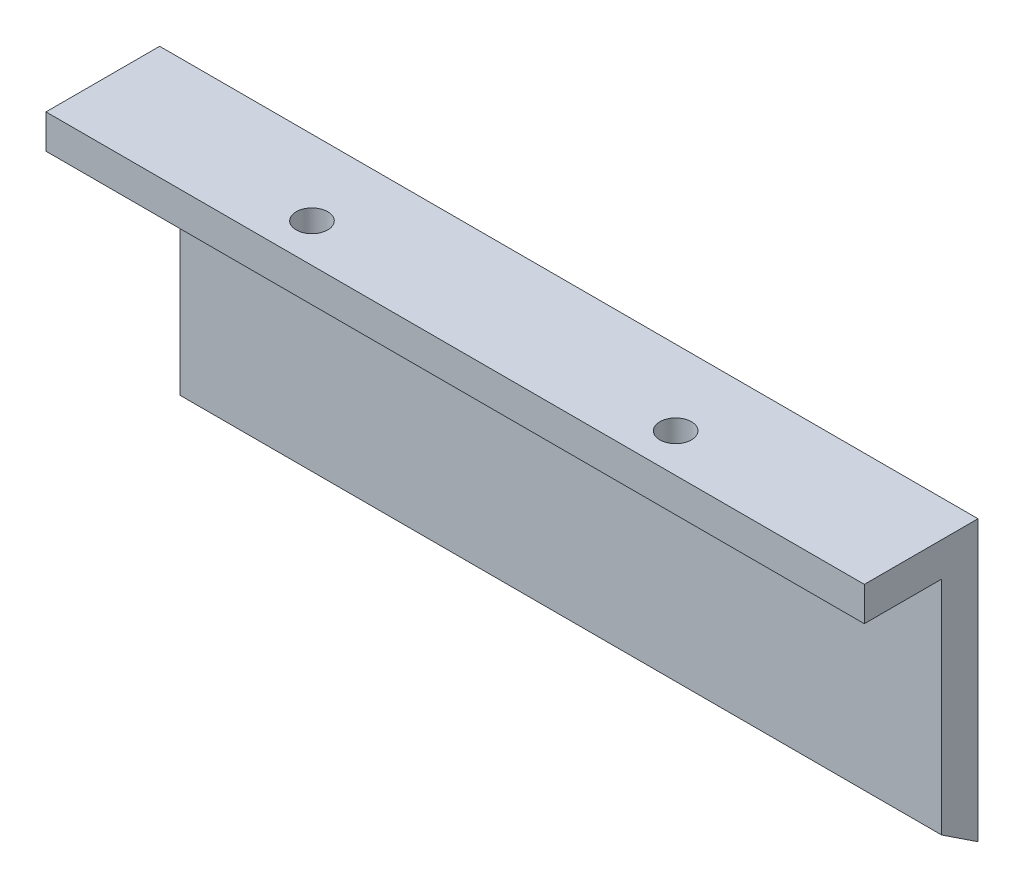
ISO-10303-21;
HEADER;
FILE_DESCRIPTION(('STEP AP214'),'2;1');
FILE_NAME('part.step','',(''),(''),'','','');
FILE_SCHEMA(('AUTOMOTIVE_DESIGN { 1 0 10303 214 1 1 1 1 }'));
ENDSEC;
DATA;
#1=APPLICATION_CONTEXT('core data for automotive mechanical design processes');
#2=APPLICATION_PROTOCOL_DEFINITION('international standard','automotive_design',2000,#1);
#3=PRODUCT_CONTEXT('',#1,'mechanical');
#4=PRODUCT('Part','Part','',(#3));
#5=PRODUCT_RELATED_PRODUCT_CATEGORY('part','',(#4));
#6=PRODUCT_DEFINITION_FORMATION('','',#4);
#7=PRODUCT_DEFINITION_CONTEXT('part definition',#1,'design');
#8=PRODUCT_DEFINITION('design','',#6,#7);
#9=PRODUCT_DEFINITION_SHAPE('','',#8);
#10=(LENGTH_UNIT() NAMED_UNIT(*) SI_UNIT(.MILLI.,.METRE.));
#11=(NAMED_UNIT(*) PLANE_ANGLE_UNIT() SI_UNIT($,.RADIAN.));
#12=(NAMED_UNIT(*) SI_UNIT($,.STERADIAN.) SOLID_ANGLE_UNIT());
#13=UNCERTAINTY_MEASURE_WITH_UNIT(LENGTH_MEASURE(1.E-05),#10,'distance_accuracy_value','');
#14=(GEOMETRIC_REPRESENTATION_CONTEXT(3) GLOBAL_UNCERTAINTY_ASSIGNED_CONTEXT((#13)) GLOBAL_UNIT_ASSIGNED_CONTEXT((#10,
#11,#12)) REPRESENTATION_CONTEXT('',''));
#15=CARTESIAN_POINT('',(0.,0.,0.));
#16=DIRECTION('',(0.,0.,1.));
#17=DIRECTION('',(1.,0.,0.));
#18=AXIS2_PLACEMENT_3D('',#15,#16,#17);
#19=CARTESIAN_POINT('',(67.,21.6124160592128,0.));
#20=DIRECTION('',(0.,0.,1.));
#21=DIRECTION('',(1.,0.,0.));
#22=AXIS2_PLACEMENT_3D('',#19,#20,#21);
#23=PLANE('',#22);
#24=DIRECTION('',(0.,1.,0.));
#25=VECTOR('',#24,1.);
#26=CARTESIAN_POINT('',(0.,21.6124160592128,0.));
#27=LINE('',#26,#25);
#28=CARTESIAN_POINT('',(0.,0.,0.));
#29=VERTEX_POINT('',#28);
#30=CARTESIAN_POINT('',(0.,21.6124160592128,0.));
#31=VERTEX_POINT('',#30);
#32=EDGE_CURVE('E82',#29,#31,#27,.T.);
#33=ORIENTED_EDGE('',*,*,#32,.T.);
#34=DIRECTION('',(-1.,0.,0.));
#35=VECTOR('',#34,1.);
#36=CARTESIAN_POINT('',(67.,21.6124160592128,0.));
#37=LINE('',#36,#35);
#38=CARTESIAN_POINT('',(-4.99999999999999,21.6124160592128,0.));
#39=VERTEX_POINT('',#38);
#40=EDGE_CURVE('E113',#31,#39,#37,.T.);
#41=ORIENTED_EDGE('',*,*,#40,.T.);
#42=DIRECTION('',(0.,-1.,0.));
#43=VECTOR('',#42,1.);
#44=CARTESIAN_POINT('',(-4.99999999999999,24.6124160592128,0.));
#45=LINE('',#44,#43);
#46=CARTESIAN_POINT('',(-4.99999999999999,24.6124160592128,0.));
#47=VERTEX_POINT('',#46);
#48=EDGE_CURVE('E88',#47,#39,#45,.T.);
#49=ORIENTED_EDGE('',*,*,#48,.F.);
#50=DIRECTION('',(-1.,0.,0.));
#51=VECTOR('',#50,1.);
#52=CARTESIAN_POINT('',(67.,24.6124160592128,0.));
#53=LINE('',#52,#51);
#54=CARTESIAN_POINT('',(67.,24.6124160592128,0.));
#55=VERTEX_POINT('',#54);
#56=EDGE_CURVE('E124',#55,#47,#53,.T.);
#57=ORIENTED_EDGE('',*,*,#56,.F.);
#58=DIRECTION('',(0.,1.,0.));
#59=VECTOR('',#58,1.);
#60=CARTESIAN_POINT('',(67.,21.6124160592128,0.));
#61=LINE('',#60,#59);
#62=CARTESIAN_POINT('',(67.,0.,0.));
#63=VERTEX_POINT('',#62);
#64=EDGE_CURVE('E77',#63,#55,#61,.T.);
#65=ORIENTED_EDGE('',*,*,#64,.F.);
#66=DIRECTION('',(-1.,0.,0.));
#67=VECTOR('',#66,1.);
#68=CARTESIAN_POINT('',(67.,0.,0.));
#69=LINE('',#68,#67);
#70=EDGE_CURVE('E73',#63,#29,#69,.T.);
#71=ORIENTED_EDGE('',*,*,#70,.T.);
#72=EDGE_LOOP('',(#33,#41,#49,#57,#65,#71));
#73=FACE_BOUND('',#72,.T.);
#74=ADVANCED_FACE('F36',(#73),#23,.F.);
#75=CARTESIAN_POINT('',(67.,2.11241605921285,3.2));
#76=DIRECTION('',(0.,0.,-1.));
#77=DIRECTION('',(0.,1.,0.));
#78=AXIS2_PLACEMENT_3D('',#75,#76,#77);
#79=PLANE('',#78);
#80=DIRECTION('',(0.,-1.,0.));
#81=VECTOR('',#80,1.);
#82=CARTESIAN_POINT('',(0.,2.11241605921285,3.2));
#83=LINE('',#82,#81);
#84=CARTESIAN_POINT('',(0.,21.6124160592128,3.2));
#85=VERTEX_POINT('',#84);
#86=CARTESIAN_POINT('',(0.,2.11241605921285,3.2));
#87=VERTEX_POINT('',#86);
#88=EDGE_CURVE('E65',#85,#87,#83,.T.);
#89=ORIENTED_EDGE('',*,*,#88,.T.);
#90=DIRECTION('',(-1.,0.,0.));
#91=VECTOR('',#90,1.);
#92=CARTESIAN_POINT('',(67.,2.11241605921285,3.2));
#93=LINE('',#92,#91);
#94=CARTESIAN_POINT('',(67.,2.11241605921285,3.2));
#95=VERTEX_POINT('',#94);
#96=EDGE_CURVE('E44',#95,#87,#93,.T.);
#97=ORIENTED_EDGE('',*,*,#96,.F.);
#98=DIRECTION('',(0.,-1.,0.));
#99=VECTOR('',#98,1.);
#100=CARTESIAN_POINT('',(67.,2.11241605921285,3.2));
#101=LINE('',#100,#99);
#102=CARTESIAN_POINT('',(67.,21.6124160592128,3.2));
#103=VERTEX_POINT('',#102);
#104=EDGE_CURVE('E97',#103,#95,#101,.T.);
#105=ORIENTED_EDGE('',*,*,#104,.F.);
#106=DIRECTION('',(-1.,0.,0.));
#107=VECTOR('',#106,1.);
#108=CARTESIAN_POINT('',(67.,21.6124160592128,3.2));
#109=LINE('',#108,#107);
#110=EDGE_CURVE('E11',#103,#85,#109,.T.);
#111=ORIENTED_EDGE('',*,*,#110,.T.);
#112=EDGE_LOOP('',(#89,#97,#105,#111));
#113=FACE_BOUND('',#112,.T.);
#114=ADVANCED_FACE('F183',(#113),#79,.F.);
#115=CARTESIAN_POINT('',(67.,0.,0.));
#116=DIRECTION('',(0.,0.834559517795937,-0.550917789925333));
#117=DIRECTION('',(0.,0.550917789925333,0.834559517795937));
#118=AXIS2_PLACEMENT_3D('',#115,#116,#117);
#119=PLANE('',#118);
#120=DIRECTION('',(0.,-0.550917789925333,-0.834559517795937));
#121=VECTOR('',#120,1.);
#122=CARTESIAN_POINT('',(0.,0.,0.));
#123=LINE('',#122,#121);
#124=EDGE_CURVE('E70',#87,#29,#123,.T.);
#125=ORIENTED_EDGE('',*,*,#124,.T.);
#126=ORIENTED_EDGE('',*,*,#70,.F.);
#127=DIRECTION('',(0.,-0.550917789925333,-0.834559517795937));
#128=VECTOR('',#127,1.);
#129=CARTESIAN_POINT('',(67.,0.,0.));
#130=LINE('',#129,#128);
#131=EDGE_CURVE('E52',#95,#63,#130,.T.);
#132=ORIENTED_EDGE('',*,*,#131,.F.);
#133=ORIENTED_EDGE('',*,*,#96,.T.);
#134=EDGE_LOOP('',(#125,#126,#132,#133));
#135=FACE_BOUND('',#134,.T.);
#136=ADVANCED_FACE('F72',(#135),#119,.F.);
#137=CARTESIAN_POINT('',(67.,0.,0.));
#138=DIRECTION('',(1.,0.,0.));
#139=DIRECTION('',(0.,0.,-1.));
#140=AXIS2_PLACEMENT_3D('',#137,#138,#139);
#141=PLANE('',#140);
#142=ORIENTED_EDGE('',*,*,#64,.T.);
#143=DIRECTION('',(0.,0.,-1.));
#144=VECTOR('',#143,1.);
#145=CARTESIAN_POINT('',(67.,24.6124160592128,0.));
#146=LINE('',#145,#144);
#147=CARTESIAN_POINT('',(67.,24.6124160592128,10.));
#148=VERTEX_POINT('',#147);
#149=EDGE_CURVE('E109',#148,#55,#146,.T.);
#150=ORIENTED_EDGE('',*,*,#149,.F.);
#151=DIRECTION('',(0.,-1.,0.));
#152=VECTOR('',#151,1.);
#153=CARTESIAN_POINT('',(67.,24.6124160592128,10.));
#154=LINE('',#153,#152);
#155=CARTESIAN_POINT('',(67.,21.6124160592128,10.));
#156=VERTEX_POINT('',#155);
#157=EDGE_CURVE('E102',#148,#156,#154,.T.);
#158=ORIENTED_EDGE('',*,*,#157,.T.);
#159=DIRECTION('',(0.,0.,-1.));
#160=VECTOR('',#159,1.);
#161=CARTESIAN_POINT('',(67.,21.6124160592128,0.));
#162=LINE('',#161,#160);
#163=EDGE_CURVE('E115',#156,#103,#162,.T.);
#164=ORIENTED_EDGE('',*,*,#163,.T.);
#165=ORIENTED_EDGE('',*,*,#104,.T.);
#166=ORIENTED_EDGE('',*,*,#131,.T.);
#167=EDGE_LOOP('',(#142,#150,#158,#164,#165,#166));
#168=FACE_BOUND('',#167,.T.);
#169=ADVANCED_FACE('F181',(#168),#141,.T.);
#170=CARTESIAN_POINT('',(0.,0.,0.));
#171=DIRECTION('',(1.,0.,0.));
#172=DIRECTION('',(0.,0.,-1.));
#173=AXIS2_PLACEMENT_3D('',#170,#171,#172);
#174=PLANE('',#173);
#175=ORIENTED_EDGE('',*,*,#32,.F.);
#176=ORIENTED_EDGE('',*,*,#124,.F.);
#177=ORIENTED_EDGE('',*,*,#88,.F.);
#178=DIRECTION('',(0.,0.,1.));
#179=VECTOR('',#178,1.);
#180=CARTESIAN_POINT('',(0.,21.6124160592128,3.2));
#181=LINE('',#180,#179);
#182=EDGE_CURVE('E87',#31,#85,#181,.T.);
#183=ORIENTED_EDGE('',*,*,#182,.F.);
#184=EDGE_LOOP('',(#175,#176,#177,#183));
#185=FACE_BOUND('',#184,.T.);
#186=ADVANCED_FACE('F86',(#185),#174,.F.);
#187=CARTESIAN_POINT('',(-4.99999999999999,24.6124160592128,0.));
#188=DIRECTION('',(1.,0.,0.));
#189=DIRECTION('',(0.,0.,-1.));
#190=AXIS2_PLACEMENT_3D('',#187,#188,#189);
#191=PLANE('',#190);
#192=DIRECTION('',(0.,0.,1.));
#193=VECTOR('',#192,1.);
#194=CARTESIAN_POINT('',(-4.99999999999999,21.6124160592128,0.));
#195=LINE('',#194,#193);
#196=CARTESIAN_POINT('',(-4.99999999999999,21.6124160592128,10.));
#197=VERTEX_POINT('',#196);
#198=EDGE_CURVE('E110',#39,#197,#195,.T.);
#199=ORIENTED_EDGE('',*,*,#198,.T.);
#200=DIRECTION('',(0.,-1.,0.));
#201=VECTOR('',#200,1.);
#202=CARTESIAN_POINT('',(-4.99999999999999,24.6124160592128,10.));
#203=LINE('',#202,#201);
#204=CARTESIAN_POINT('',(-4.99999999999999,24.6124160592128,10.));
#205=VERTEX_POINT('',#204);
#206=EDGE_CURVE('E92',#205,#197,#203,.T.);
#207=ORIENTED_EDGE('',*,*,#206,.F.);
#208=DIRECTION('',(0.,0.,1.));
#209=VECTOR('',#208,1.);
#210=CARTESIAN_POINT('',(-4.99999999999999,24.6124160592128,0.));
#211=LINE('',#210,#209);
#212=EDGE_CURVE('E121',#47,#205,#211,.T.);
#213=ORIENTED_EDGE('',*,*,#212,.F.);
#214=ORIENTED_EDGE('',*,*,#48,.T.);
#215=EDGE_LOOP('',(#199,#207,#213,#214));
#216=FACE_BOUND('',#215,.T.);
#217=ADVANCED_FACE('F163',(#216),#191,.F.);
#218=CARTESIAN_POINT('',(67.,24.6124160592128,10.));
#219=DIRECTION('',(0.,0.,-1.));
#220=DIRECTION('',(-1.,0.,0.));
#221=AXIS2_PLACEMENT_3D('',#218,#219,#220);
#222=PLANE('',#221);
#223=DIRECTION('',(1.,0.,0.));
#224=VECTOR('',#223,1.);
#225=CARTESIAN_POINT('',(67.,21.6124160592128,10.));
#226=LINE('',#225,#224);
#227=EDGE_CURVE('E106',#197,#156,#226,.T.);
#228=ORIENTED_EDGE('',*,*,#227,.T.);
#229=ORIENTED_EDGE('',*,*,#157,.F.);
#230=DIRECTION('',(1.,0.,0.));
#231=VECTOR('',#230,1.);
#232=CARTESIAN_POINT('',(67.,24.6124160592128,10.));
#233=LINE('',#232,#231);
#234=EDGE_CURVE('E105',#205,#148,#233,.T.);
#235=ORIENTED_EDGE('',*,*,#234,.F.);
#236=ORIENTED_EDGE('',*,*,#206,.T.);
#237=EDGE_LOOP('',(#228,#229,#235,#236));
#238=FACE_BOUND('',#237,.T.);
#239=ADVANCED_FACE('F197',(#238),#222,.F.);
#240=CARTESIAN_POINT('',(0.,24.6124160592128,0.));
#241=DIRECTION('',(0.,-1.,0.));
#242=DIRECTION('',(0.,0.,-1.));
#243=AXIS2_PLACEMENT_3D('',#240,#241,#242);
#244=PLANE('',#243);
#245=CARTESIAN_POINT('',(47.,24.6124160592128,6.6));
#246=DIRECTION('',(0.,-1.,0.));
#247=DIRECTION('',(0.,0.,-1.));
#248=AXIS2_PLACEMENT_3D('',#245,#246,#247);
#249=CIRCLE('',#248,1.3890625);
#250=CARTESIAN_POINT('',(47.,24.6124160592128,5.2109375));
#251=VERTEX_POINT('',#250);
#252=EDGE_CURVE('E118',#251,#251,#249,.F.);
#253=ORIENTED_EDGE('',*,*,#252,.F.);
#254=EDGE_LOOP('',(#253));
#255=FACE_BOUND('',#254,.T.);
#256=CARTESIAN_POINT('',(15.,24.6124160592128,6.6));
#257=DIRECTION('',(0.,-1.,0.));
#258=DIRECTION('',(0.,0.,-1.));
#259=AXIS2_PLACEMENT_3D('',#256,#257,#258);
#260=CIRCLE('',#259,1.3890625);
#261=CARTESIAN_POINT('',(15.,24.6124160592128,5.21093749999999));
#262=VERTEX_POINT('',#261);
#263=EDGE_CURVE('E129',#262,#262,#260,.F.);
#264=ORIENTED_EDGE('',*,*,#263,.F.);
#265=EDGE_LOOP('',(#264));
#266=FACE_BOUND('',#265,.T.);
#267=ORIENTED_EDGE('',*,*,#149,.T.);
#268=ORIENTED_EDGE('',*,*,#56,.T.);
#269=ORIENTED_EDGE('',*,*,#212,.T.);
#270=ORIENTED_EDGE('',*,*,#234,.T.);
#271=EDGE_LOOP('',(#267,#268,#269,#270));
#272=FACE_BOUND('',#271,.T.);
#273=ADVANCED_FACE('F147',(#255,#266,#272),#244,.F.);
#274=CARTESIAN_POINT('',(0.,21.6124160592128,0.));
#275=DIRECTION('',(0.,-1.,0.));
#276=DIRECTION('',(0.,0.,-1.));
#277=AXIS2_PLACEMENT_3D('',#274,#275,#276);
#278=PLANE('',#277);
#279=CARTESIAN_POINT('',(47.,21.6124160592128,6.6));
#280=DIRECTION('',(0.,-1.,0.));
#281=DIRECTION('',(0.,0.,-1.));
#282=AXIS2_PLACEMENT_3D('',#279,#280,#281);
#283=CIRCLE('',#282,1.3890625);
#284=CARTESIAN_POINT('',(47.,21.6124160592128,5.2109375));
#285=VERTEX_POINT('',#284);
#286=EDGE_CURVE('E132',#285,#285,#283,.T.);
#287=ORIENTED_EDGE('',*,*,#286,.F.);
#288=EDGE_LOOP('',(#287));
#289=FACE_BOUND('',#288,.T.);
#290=CARTESIAN_POINT('',(15.,21.6124160592128,6.6));
#291=DIRECTION('',(0.,-1.,0.));
#292=DIRECTION('',(0.,0.,-1.));
#293=AXIS2_PLACEMENT_3D('',#290,#291,#292);
#294=CIRCLE('',#293,1.3890625);
#295=CARTESIAN_POINT('',(15.,21.6124160592128,5.21093749999999));
#296=VERTEX_POINT('',#295);
#297=EDGE_CURVE('E133',#296,#296,#294,.T.);
#298=ORIENTED_EDGE('',*,*,#297,.F.);
#299=EDGE_LOOP('',(#298));
#300=FACE_BOUND('',#299,.T.);
#301=ORIENTED_EDGE('',*,*,#40,.F.);
#302=ORIENTED_EDGE('',*,*,#182,.T.);
#303=ORIENTED_EDGE('',*,*,#110,.F.);
#304=ORIENTED_EDGE('',*,*,#163,.F.);
#305=ORIENTED_EDGE('',*,*,#227,.F.);
#306=ORIENTED_EDGE('',*,*,#198,.F.);
#307=EDGE_LOOP('',(#301,#302,#303,#304,#305,#306));
#308=FACE_BOUND('',#307,.T.);
#309=ADVANCED_FACE('F143',(#289,#300,#308),#278,.T.);
#310=CARTESIAN_POINT('',(15.,28.5412781121806,6.6));
#311=DIRECTION('',(0.,-1.,0.));
#312=DIRECTION('',(0.,0.,-1.));
#313=AXIS2_PLACEMENT_3D('',#310,#311,#312);
#314=CYLINDRICAL_SURFACE('',#313,1.3890625);
#315=ORIENTED_EDGE('',*,*,#263,.T.);
#316=EDGE_LOOP('',(#315));
#317=FACE_BOUND('',#316,.T.);
#318=ORIENTED_EDGE('',*,*,#297,.T.);
#319=EDGE_LOOP('',(#318));
#320=FACE_BOUND('',#319,.T.);
#321=ADVANCED_FACE('F146',(#317,#320),#314,.F.);
#322=CARTESIAN_POINT('',(47.,28.5412781121806,6.6));
#323=DIRECTION('',(0.,-1.,0.));
#324=DIRECTION('',(0.,0.,-1.));
#325=AXIS2_PLACEMENT_3D('',#322,#323,#324);
#326=CYLINDRICAL_SURFACE('',#325,1.3890625);
#327=ORIENTED_EDGE('',*,*,#252,.T.);
#328=EDGE_LOOP('',(#327));
#329=FACE_BOUND('',#328,.T.);
#330=ORIENTED_EDGE('',*,*,#286,.T.);
#331=EDGE_LOOP('',(#330));
#332=FACE_BOUND('',#331,.T.);
#333=ADVANCED_FACE('F141',(#329,#332),#326,.F.);
#334=CLOSED_SHELL('',(#74,#114,#136,#169,#186,#217,#239,#273,#309,#321,#333));
#335=MANIFOLD_SOLID_BREP('B2',#334);
#336=ADVANCED_BREP_SHAPE_REPRESENTATION('',(#18,#335),#14);
#337=SHAPE_DEFINITION_REPRESENTATION(#9,#336);
ENDSEC;
END-ISO-10303-21;
